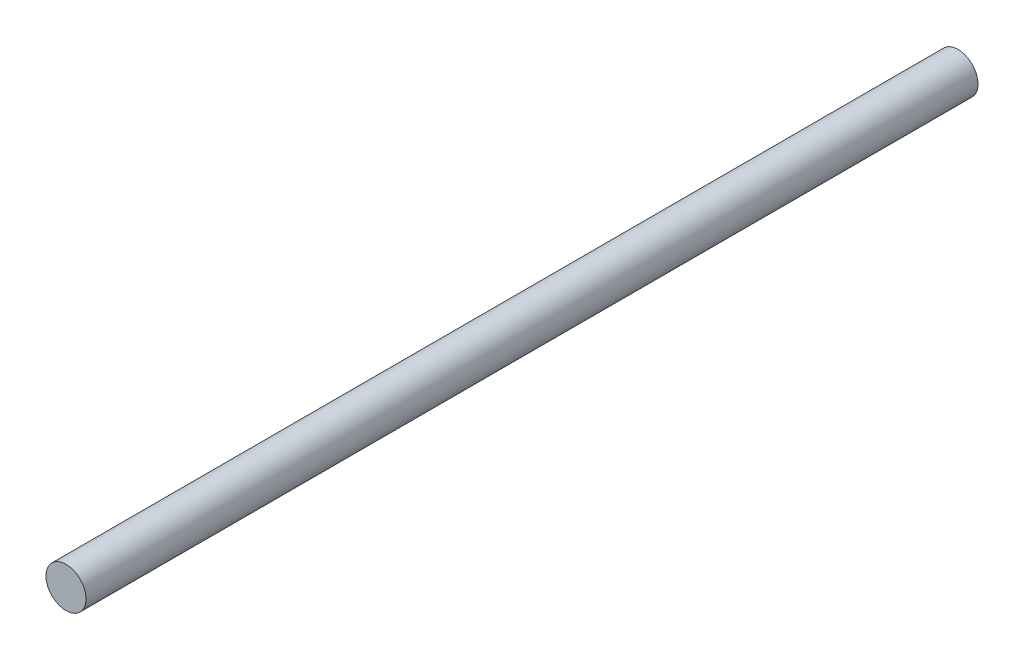
ISO-10303-21;
HEADER;
FILE_DESCRIPTION(('STEP AP214'),'2;1');
FILE_NAME('part.step','',(''),(''),'','','');
FILE_SCHEMA(('AUTOMOTIVE_DESIGN { 1 0 10303 214 1 1 1 1 }'));
ENDSEC;
DATA;
#1=APPLICATION_CONTEXT('core data for automotive mechanical design processes');
#2=APPLICATION_PROTOCOL_DEFINITION('international standard','automotive_design',2000,#1);
#3=PRODUCT_CONTEXT('',#1,'mechanical');
#4=PRODUCT('Part','Part','',(#3));
#5=PRODUCT_RELATED_PRODUCT_CATEGORY('part','',(#4));
#6=PRODUCT_DEFINITION_FORMATION('','',#4);
#7=PRODUCT_DEFINITION_CONTEXT('part definition',#1,'design');
#8=PRODUCT_DEFINITION('design','',#6,#7);
#9=PRODUCT_DEFINITION_SHAPE('','',#8);
#10=(LENGTH_UNIT() NAMED_UNIT(*) SI_UNIT(.MILLI.,.METRE.));
#11=(NAMED_UNIT(*) PLANE_ANGLE_UNIT() SI_UNIT($,.RADIAN.));
#12=(NAMED_UNIT(*) SI_UNIT($,.STERADIAN.) SOLID_ANGLE_UNIT());
#13=UNCERTAINTY_MEASURE_WITH_UNIT(LENGTH_MEASURE(1.E-05),#10,'distance_accuracy_value','');
#14=(GEOMETRIC_REPRESENTATION_CONTEXT(3) GLOBAL_UNCERTAINTY_ASSIGNED_CONTEXT((#13)) GLOBAL_UNIT_ASSIGNED_CONTEXT((#10,
#11,#12)) REPRESENTATION_CONTEXT('',''));
#15=CARTESIAN_POINT('',(0.,0.,0.));
#16=DIRECTION('',(0.,0.,1.));
#17=DIRECTION('',(1.,0.,0.));
#18=AXIS2_PLACEMENT_3D('',#15,#16,#17);
#19=CARTESIAN_POINT('',(0.,0.,222.5));
#20=DIRECTION('',(0.,0.,-1.));
#21=DIRECTION('',(-1.,0.,0.));
#22=AXIS2_PLACEMENT_3D('',#19,#20,#21);
#23=CYLINDRICAL_SURFACE('',#22,10.);
#24=CARTESIAN_POINT('',(0.,0.,222.5));
#25=DIRECTION('',(0.,0.,1.));
#26=DIRECTION('',(1.,0.,0.));
#27=AXIS2_PLACEMENT_3D('',#24,#25,#26);
#28=CIRCLE('',#27,10.);
#29=CARTESIAN_POINT('',(10.,0.,222.5));
#30=VERTEX_POINT('',#29);
#31=EDGE_CURVE('E10',#30,#30,#28,.T.);
#32=ORIENTED_EDGE('',*,*,#31,.F.);
#33=EDGE_LOOP('',(#32));
#34=FACE_BOUND('',#33,.T.);
#35=CARTESIAN_POINT('',(0.,0.,-222.5));
#36=DIRECTION('',(0.,0.,1.));
#37=DIRECTION('',(1.,0.,0.));
#38=AXIS2_PLACEMENT_3D('',#35,#36,#37);
#39=CIRCLE('',#38,10.);
#40=CARTESIAN_POINT('',(10.,0.,-222.5));
#41=VERTEX_POINT('',#40);
#42=EDGE_CURVE('E39',#41,#41,#39,.T.);
#43=ORIENTED_EDGE('',*,*,#42,.T.);
#44=EDGE_LOOP('',(#43));
#45=FACE_BOUND('',#44,.T.);
#46=ADVANCED_FACE('F36',(#34,#45),#23,.T.);
#47=CARTESIAN_POINT('',(0.,0.,222.5));
#48=DIRECTION('',(0.,0.,1.));
#49=DIRECTION('',(1.,0.,0.));
#50=AXIS2_PLACEMENT_3D('',#47,#48,#49);
#51=PLANE('',#50);
#52=ORIENTED_EDGE('',*,*,#31,.T.);
#53=EDGE_LOOP('',(#52));
#54=FACE_BOUND('',#53,.T.);
#55=ADVANCED_FACE('F51',(#54),#51,.T.);
#56=CARTESIAN_POINT('',(0.,0.,-222.5));
#57=DIRECTION('',(0.,0.,1.));
#58=DIRECTION('',(1.,0.,0.));
#59=AXIS2_PLACEMENT_3D('',#56,#57,#58);
#60=PLANE('',#59);
#61=ORIENTED_EDGE('',*,*,#42,.F.);
#62=EDGE_LOOP('',(#61));
#63=FACE_BOUND('',#62,.T.);
#64=ADVANCED_FACE('F49',(#63),#60,.F.);
#65=CLOSED_SHELL('',(#46,#55,#64));
#66=MANIFOLD_SOLID_BREP('B2',#65);
#67=ADVANCED_BREP_SHAPE_REPRESENTATION('',(#18,#66),#14);
#68=SHAPE_DEFINITION_REPRESENTATION(#9,#67);
ENDSEC;
END-ISO-10303-21;
